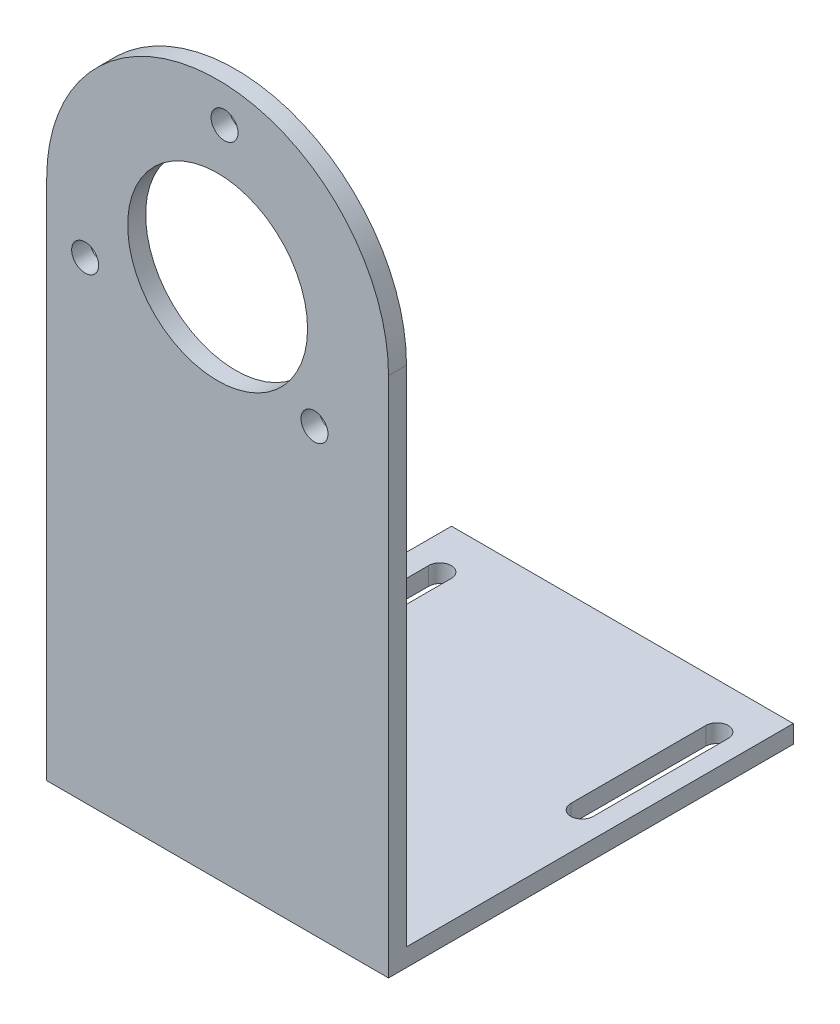
ISO-10303-21;
HEADER;
FILE_DESCRIPTION(('STEP AP214'),'2;1');
FILE_NAME('part.step','',(''),(''),'','','');
FILE_SCHEMA(('AUTOMOTIVE_DESIGN { 1 0 10303 214 1 1 1 1 }'));
ENDSEC;
DATA;
#1=APPLICATION_CONTEXT('core data for automotive mechanical design processes');
#2=APPLICATION_PROTOCOL_DEFINITION('international standard','automotive_design',2000,#1);
#3=PRODUCT_CONTEXT('',#1,'mechanical');
#4=PRODUCT('Part','Part','',(#3));
#5=PRODUCT_RELATED_PRODUCT_CATEGORY('part','',(#4));
#6=PRODUCT_DEFINITION_FORMATION('','',#4);
#7=PRODUCT_DEFINITION_CONTEXT('part definition',#1,'design');
#8=PRODUCT_DEFINITION('design','',#6,#7);
#9=PRODUCT_DEFINITION_SHAPE('','',#8);
#10=(LENGTH_UNIT() NAMED_UNIT(*) SI_UNIT(.MILLI.,.METRE.));
#11=(NAMED_UNIT(*) PLANE_ANGLE_UNIT() SI_UNIT($,.RADIAN.));
#12=(NAMED_UNIT(*) SI_UNIT($,.STERADIAN.) SOLID_ANGLE_UNIT());
#13=UNCERTAINTY_MEASURE_WITH_UNIT(LENGTH_MEASURE(1.E-05),#10,'distance_accuracy_value','');
#14=(GEOMETRIC_REPRESENTATION_CONTEXT(3) GLOBAL_UNCERTAINTY_ASSIGNED_CONTEXT((#13)) GLOBAL_UNIT_ASSIGNED_CONTEXT((#10,
#11,#12)) REPRESENTATION_CONTEXT('',''));
#15=CARTESIAN_POINT('',(0.,0.,0.));
#16=DIRECTION('',(0.,0.,1.));
#17=DIRECTION('',(1.,0.,0.));
#18=AXIS2_PLACEMENT_3D('',#15,#16,#17);
#19=CARTESIAN_POINT('',(-31.7702658504087,2.,-20.5517876073027));
#20=DIRECTION('',(1.,0.,0.));
#21=DIRECTION('',(0.,0.,-1.));
#22=AXIS2_PLACEMENT_3D('',#19,#20,#21);
#23=PLANE('',#22);
#24=DIRECTION('',(0.,0.,1.));
#25=VECTOR('',#24,1.);
#26=CARTESIAN_POINT('',(-31.7702658504087,0.,-20.5517876073027));
#27=LINE('',#26,#25);
#28=CARTESIAN_POINT('',(-31.7702658504087,0.,-20.5517876073027));
#29=VERTEX_POINT('',#28);
#30=CARTESIAN_POINT('',(-31.7702658504087,0.,24.4482123926973));
#31=VERTEX_POINT('',#30);
#32=EDGE_CURVE('E234',#29,#31,#27,.T.);
#33=ORIENTED_EDGE('',*,*,#32,.T.);
#34=DIRECTION('',(0.,-1.,0.));
#35=VECTOR('',#34,1.);
#36=CARTESIAN_POINT('',(-31.7702658504087,2.,24.4482123926973));
#37=LINE('',#36,#35);
#38=CARTESIAN_POINT('',(-31.7702658504087,58.,24.4482123926973));
#39=VERTEX_POINT('',#38);
#40=EDGE_CURVE('E11',#39,#31,#37,.T.);
#41=ORIENTED_EDGE('',*,*,#40,.F.);
#42=DIRECTION('',(0.,0.,1.));
#43=VECTOR('',#42,1.);
#44=CARTESIAN_POINT('',(-31.7702658504087,58.,22.4482123926973));
#45=LINE('',#44,#43);
#46=CARTESIAN_POINT('',(-31.7702658504087,58.,22.4482123926973));
#47=VERTEX_POINT('',#46);
#48=EDGE_CURVE('E230',#47,#39,#45,.T.);
#49=ORIENTED_EDGE('',*,*,#48,.F.);
#50=DIRECTION('',(0.,-1.,0.));
#51=VECTOR('',#50,1.);
#52=CARTESIAN_POINT('',(-31.7702658504087,0.,22.4482123926973));
#53=LINE('',#52,#51);
#54=CARTESIAN_POINT('',(-31.7702658504087,2.,22.4482123926973));
#55=VERTEX_POINT('',#54);
#56=EDGE_CURVE('E217',#47,#55,#53,.T.);
#57=ORIENTED_EDGE('',*,*,#56,.T.);
#58=DIRECTION('',(0.,0.,1.));
#59=VECTOR('',#58,1.);
#60=CARTESIAN_POINT('',(-31.7702658504087,2.,-20.5517876073027));
#61=LINE('',#60,#59);
#62=CARTESIAN_POINT('',(-31.7702658504087,2.,-20.5517876073027));
#63=VERTEX_POINT('',#62);
#64=EDGE_CURVE('E236',#63,#55,#61,.T.);
#65=ORIENTED_EDGE('',*,*,#64,.F.);
#66=DIRECTION('',(0.,-1.,0.));
#67=VECTOR('',#66,1.);
#68=CARTESIAN_POINT('',(-31.7702658504087,2.,-20.5517876073027));
#69=LINE('',#68,#67);
#70=EDGE_CURVE('E243',#63,#29,#69,.T.);
#71=ORIENTED_EDGE('',*,*,#70,.T.);
#72=EDGE_LOOP('',(#33,#41,#49,#57,#65,#71));
#73=FACE_BOUND('',#72,.T.);
#74=ADVANCED_FACE('F37',(#73),#23,.F.);
#75=CARTESIAN_POINT('',(-31.7702658504087,2.,24.4482123926973));
#76=DIRECTION('',(0.,0.,-1.));
#77=DIRECTION('',(-1.,0.,0.));
#78=AXIS2_PLACEMENT_3D('',#75,#76,#77);
#79=PLANE('',#78);
#80=CARTESIAN_POINT('',(-12.,73.,24.4482123926973));
#81=DIRECTION('',(0.,0.,1.));
#82=DIRECTION('',(1.,0.,0.));
#83=AXIS2_PLACEMENT_3D('',#80,#81,#82);
#84=CIRCLE('',#83,1.5);
#85=CARTESIAN_POINT('',(-10.5,73.,24.4482123926973));
#86=VERTEX_POINT('',#85);
#87=EDGE_CURVE('E505',#86,#86,#84,.T.);
#88=ORIENTED_EDGE('',*,*,#87,.F.);
#89=EDGE_LOOP('',(#88));
#90=FACE_BOUND('',#89,.T.);
#91=CARTESIAN_POINT('',(-2.,49.,24.4482123926973));
#92=DIRECTION('',(0.,0.,1.));
#93=DIRECTION('',(1.,0.,0.));
#94=AXIS2_PLACEMENT_3D('',#91,#92,#93);
#95=CIRCLE('',#94,1.5);
#96=CARTESIAN_POINT('',(-0.499999999999998,49.,24.4482123926973));
#97=VERTEX_POINT('',#96);
#98=EDGE_CURVE('E510',#97,#97,#95,.T.);
#99=ORIENTED_EDGE('',*,*,#98,.F.);
#100=EDGE_LOOP('',(#99));
#101=FACE_BOUND('',#100,.T.);
#102=CARTESIAN_POINT('',(-27.5,52.5,24.4482123926973));
#103=DIRECTION('',(0.,0.,1.));
#104=DIRECTION('',(1.,0.,0.));
#105=AXIS2_PLACEMENT_3D('',#102,#103,#104);
#106=CIRCLE('',#105,1.5);
#107=CARTESIAN_POINT('',(-26.,52.5,24.4482123926973));
#108=VERTEX_POINT('',#107);
#109=EDGE_CURVE('E164',#108,#108,#106,.T.);
#110=ORIENTED_EDGE('',*,*,#109,.F.);
#111=EDGE_LOOP('',(#110));
#112=FACE_BOUND('',#111,.T.);
#113=DIRECTION('',(1.,0.,0.));
#114=VECTOR('',#113,1.);
#115=CARTESIAN_POINT('',(-31.7702658504087,0.,24.4482123926973));
#116=LINE('',#115,#114);
#117=CARTESIAN_POINT('',(6.22973414959135,0.,24.4482123926973));
#118=VERTEX_POINT('',#117);
#119=EDGE_CURVE('E246',#31,#118,#116,.T.);
#120=ORIENTED_EDGE('',*,*,#119,.T.);
#121=DIRECTION('',(0.,-1.,0.));
#122=VECTOR('',#121,1.);
#123=CARTESIAN_POINT('',(6.22973414959135,2.,24.4482123926973));
#124=LINE('',#123,#122);
#125=CARTESIAN_POINT('',(6.22973414959135,58.,24.4482123926973));
#126=VERTEX_POINT('',#125);
#127=EDGE_CURVE('E44',#126,#118,#124,.T.);
#128=ORIENTED_EDGE('',*,*,#127,.F.);
#129=CARTESIAN_POINT('',(-12.7702658504087,58.,24.4482123926973));
#130=DIRECTION('',(0.,0.,1.));
#131=DIRECTION('',(1.,0.,0.));
#132=AXIS2_PLACEMENT_3D('',#129,#130,#131);
#133=CIRCLE('',#132,19.);
#134=EDGE_CURVE('E215',#126,#39,#133,.T.);
#135=ORIENTED_EDGE('',*,*,#134,.T.);
#136=ORIENTED_EDGE('',*,*,#40,.T.);
#137=EDGE_LOOP('',(#120,#128,#135,#136));
#138=FACE_BOUND('',#137,.T.);
#139=CARTESIAN_POINT('',(-12.7702658504087,58.,24.4482123926973));
#140=DIRECTION('',(0.,0.,1.));
#141=DIRECTION('',(1.,0.,0.));
#142=AXIS2_PLACEMENT_3D('',#139,#140,#141);
#143=CIRCLE('',#142,10.);
#144=CARTESIAN_POINT('',(-2.77026585040865,58.,24.4482123926973));
#145=VERTEX_POINT('',#144);
#146=EDGE_CURVE('E177',#145,#145,#143,.T.);
#147=ORIENTED_EDGE('',*,*,#146,.F.);
#148=EDGE_LOOP('',(#147));
#149=FACE_BOUND('',#148,.T.);
#150=ADVANCED_FACE('F284',(#90,#101,#112,#138,#149),#79,.F.);
#151=CARTESIAN_POINT('',(6.22973414959134,2.,-20.5517876073027));
#152=DIRECTION('',(-1.,0.,0.));
#153=DIRECTION('',(0.,0.,1.));
#154=AXIS2_PLACEMENT_3D('',#151,#152,#153);
#155=PLANE('',#154);
#156=DIRECTION('',(0.,0.,-1.));
#157=VECTOR('',#156,1.);
#158=CARTESIAN_POINT('',(6.22973414959134,0.,-20.5517876073027));
#159=LINE('',#158,#157);
#160=CARTESIAN_POINT('',(6.22973414959134,0.,-20.5517876073027));
#161=VERTEX_POINT('',#160);
#162=EDGE_CURVE('E248',#118,#161,#159,.T.);
#163=ORIENTED_EDGE('',*,*,#162,.T.);
#164=DIRECTION('',(0.,-1.,0.));
#165=VECTOR('',#164,1.);
#166=CARTESIAN_POINT('',(6.22973414959134,2.,-20.5517876073027));
#167=LINE('',#166,#165);
#168=CARTESIAN_POINT('',(6.22973414959134,2.,-20.5517876073027));
#169=VERTEX_POINT('',#168);
#170=EDGE_CURVE('E253',#169,#161,#167,.T.);
#171=ORIENTED_EDGE('',*,*,#170,.F.);
#172=DIRECTION('',(0.,0.,-1.));
#173=VECTOR('',#172,1.);
#174=CARTESIAN_POINT('',(6.22973414959134,2.,-20.5517876073027));
#175=LINE('',#174,#173);
#176=CARTESIAN_POINT('',(6.22973414959135,2.,22.4482123926973));
#177=VERTEX_POINT('',#176);
#178=EDGE_CURVE('E238',#177,#169,#175,.T.);
#179=ORIENTED_EDGE('',*,*,#178,.F.);
#180=DIRECTION('',(0.,-1.,0.));
#181=VECTOR('',#180,1.);
#182=CARTESIAN_POINT('',(6.22973414959135,0.,22.4482123926973));
#183=LINE('',#182,#181);
#184=CARTESIAN_POINT('',(6.22973414959135,58.,22.4482123926973));
#185=VERTEX_POINT('',#184);
#186=EDGE_CURVE('E227',#185,#177,#183,.T.);
#187=ORIENTED_EDGE('',*,*,#186,.F.);
#188=DIRECTION('',(0.,0.,1.));
#189=VECTOR('',#188,1.);
#190=CARTESIAN_POINT('',(6.22973414959135,58.,22.4482123926973));
#191=LINE('',#190,#189);
#192=EDGE_CURVE('E231',#185,#126,#191,.T.);
#193=ORIENTED_EDGE('',*,*,#192,.T.);
#194=ORIENTED_EDGE('',*,*,#127,.T.);
#195=EDGE_LOOP('',(#163,#171,#179,#187,#193,#194));
#196=FACE_BOUND('',#195,.T.);
#197=ADVANCED_FACE('F259',(#196),#155,.F.);
#198=CARTESIAN_POINT('',(-31.7702658504087,2.,-20.5517876073027));
#199=DIRECTION('',(0.,0.,1.));
#200=DIRECTION('',(1.,0.,0.));
#201=AXIS2_PLACEMENT_3D('',#198,#199,#200);
#202=PLANE('',#201);
#203=DIRECTION('',(-1.,0.,0.));
#204=VECTOR('',#203,1.);
#205=CARTESIAN_POINT('',(-31.7702658504087,0.,-20.5517876073027));
#206=LINE('',#205,#204);
#207=EDGE_CURVE('E239',#161,#29,#206,.T.);
#208=ORIENTED_EDGE('',*,*,#207,.T.);
#209=ORIENTED_EDGE('',*,*,#70,.F.);
#210=DIRECTION('',(-1.,0.,0.));
#211=VECTOR('',#210,1.);
#212=CARTESIAN_POINT('',(-31.7702658504087,2.,-20.5517876073027));
#213=LINE('',#212,#211);
#214=EDGE_CURVE('E241',#169,#63,#213,.T.);
#215=ORIENTED_EDGE('',*,*,#214,.F.);
#216=ORIENTED_EDGE('',*,*,#170,.T.);
#217=EDGE_LOOP('',(#208,#209,#215,#216));
#218=FACE_BOUND('',#217,.T.);
#219=ADVANCED_FACE('F269',(#218),#202,.F.);
#220=CARTESIAN_POINT('',(0.,2.,0.));
#221=DIRECTION('',(0.,1.,0.));
#222=DIRECTION('',(0.,0.,1.));
#223=AXIS2_PLACEMENT_3D('',#220,#221,#222);
#224=PLANE('',#223);
#225=CARTESIAN_POINT('',(2.8,2.,-0.5));
#226=DIRECTION('',(0.,1.,0.));
#227=DIRECTION('',(0.,0.,1.));
#228=AXIS2_PLACEMENT_3D('',#225,#226,#227);
#229=CIRCLE('',#228,1.25);
#230=CARTESIAN_POINT('',(1.55,2.,-0.5));
#231=VERTEX_POINT('',#230);
#232=CARTESIAN_POINT('',(4.05,2.,-0.5));
#233=VERTEX_POINT('',#232);
#234=EDGE_CURVE('E51',#231,#233,#229,.T.);
#235=ORIENTED_EDGE('',*,*,#234,.F.);
#236=DIRECTION('',(0.,0.,1.));
#237=VECTOR('',#236,1.);
#238=CARTESIAN_POINT('',(1.55,2.,-0.5));
#239=LINE('',#238,#237);
#240=CARTESIAN_POINT('',(1.55,2.,-15.5));
#241=VERTEX_POINT('',#240);
#242=EDGE_CURVE('E158',#241,#231,#239,.T.);
#243=ORIENTED_EDGE('',*,*,#242,.F.);
#244=CARTESIAN_POINT('',(2.8,2.,-15.5));
#245=DIRECTION('',(0.,1.,0.));
#246=DIRECTION('',(0.,0.,1.));
#247=AXIS2_PLACEMENT_3D('',#244,#245,#246);
#248=CIRCLE('',#247,1.25);
#249=CARTESIAN_POINT('',(4.05,2.,-15.5));
#250=VERTEX_POINT('',#249);
#251=EDGE_CURVE('E161',#250,#241,#248,.T.);
#252=ORIENTED_EDGE('',*,*,#251,.F.);
#253=DIRECTION('',(0.,0.,-1.));
#254=VECTOR('',#253,1.);
#255=CARTESIAN_POINT('',(4.05,2.,-0.5));
#256=LINE('',#255,#254);
#257=EDGE_CURVE('E170',#233,#250,#256,.T.);
#258=ORIENTED_EDGE('',*,*,#257,.F.);
#259=EDGE_LOOP('',(#235,#243,#252,#258));
#260=FACE_BOUND('',#259,.T.);
#261=CARTESIAN_POINT('',(-28.,2.,-0.5));
#262=DIRECTION('',(0.,1.,0.));
#263=DIRECTION('',(0.,0.,1.));
#264=AXIS2_PLACEMENT_3D('',#261,#262,#263);
#265=CIRCLE('',#264,1.25);
#266=CARTESIAN_POINT('',(-29.25,2.,-0.5));
#267=VERTEX_POINT('',#266);
#268=CARTESIAN_POINT('',(-26.75,2.,-0.5));
#269=VERTEX_POINT('',#268);
#270=EDGE_CURVE('E59',#267,#269,#265,.T.);
#271=ORIENTED_EDGE('',*,*,#270,.F.);
#272=DIRECTION('',(0.,0.,1.));
#273=VECTOR('',#272,1.);
#274=CARTESIAN_POINT('',(-29.25,2.,-0.5));
#275=LINE('',#274,#273);
#276=CARTESIAN_POINT('',(-29.25,2.,-15.5));
#277=VERTEX_POINT('',#276);
#278=EDGE_CURVE('E185',#277,#267,#275,.T.);
#279=ORIENTED_EDGE('',*,*,#278,.F.);
#280=CARTESIAN_POINT('',(-28.,2.,-15.5));
#281=DIRECTION('',(0.,1.,0.));
#282=DIRECTION('',(0.,0.,1.));
#283=AXIS2_PLACEMENT_3D('',#280,#281,#282);
#284=CIRCLE('',#283,1.25);
#285=CARTESIAN_POINT('',(-26.75,2.,-15.5));
#286=VERTEX_POINT('',#285);
#287=EDGE_CURVE('E200',#286,#277,#284,.T.);
#288=ORIENTED_EDGE('',*,*,#287,.F.);
#289=DIRECTION('',(0.,0.,-1.));
#290=VECTOR('',#289,1.);
#291=CARTESIAN_POINT('',(-26.75,2.,-0.5));
#292=LINE('',#291,#290);
#293=EDGE_CURVE('E196',#269,#286,#292,.T.);
#294=ORIENTED_EDGE('',*,*,#293,.F.);
#295=EDGE_LOOP('',(#271,#279,#288,#294));
#296=FACE_BOUND('',#295,.T.);
#297=DIRECTION('',(-1.,0.,0.));
#298=VECTOR('',#297,1.);
#299=CARTESIAN_POINT('',(0.,2.,22.4482123926973));
#300=LINE('',#299,#298);
#301=EDGE_CURVE('E224',#177,#55,#300,.T.);
#302=ORIENTED_EDGE('',*,*,#301,.F.);
#303=ORIENTED_EDGE('',*,*,#178,.T.);
#304=ORIENTED_EDGE('',*,*,#214,.T.);
#305=ORIENTED_EDGE('',*,*,#64,.T.);
#306=EDGE_LOOP('',(#302,#303,#304,#305));
#307=FACE_BOUND('',#306,.T.);
#308=ADVANCED_FACE('F277',(#260,#296,#307),#224,.T.);
#309=CARTESIAN_POINT('',(0.,0.,0.));
#310=DIRECTION('',(0.,1.,0.));
#311=DIRECTION('',(0.,0.,1.));
#312=AXIS2_PLACEMENT_3D('',#309,#310,#311);
#313=PLANE('',#312);
#314=DIRECTION('',(0.,0.,1.));
#315=VECTOR('',#314,1.);
#316=CARTESIAN_POINT('',(1.55,0.,-0.5));
#317=LINE('',#316,#315);
#318=CARTESIAN_POINT('',(1.55,0.,-15.5));
#319=VERTEX_POINT('',#318);
#320=CARTESIAN_POINT('',(1.55,0.,-0.5));
#321=VERTEX_POINT('',#320);
#322=EDGE_CURVE('E145',#319,#321,#317,.T.);
#323=ORIENTED_EDGE('',*,*,#322,.T.);
#324=CARTESIAN_POINT('',(2.8,0.,-0.5));
#325=DIRECTION('',(0.,1.,0.));
#326=DIRECTION('',(0.,0.,1.));
#327=AXIS2_PLACEMENT_3D('',#324,#325,#326);
#328=CIRCLE('',#327,1.25);
#329=CARTESIAN_POINT('',(4.05,0.,-0.5));
#330=VERTEX_POINT('',#329);
#331=EDGE_CURVE('E139',#321,#330,#328,.T.);
#332=ORIENTED_EDGE('',*,*,#331,.T.);
#333=DIRECTION('',(0.,0.,-1.));
#334=VECTOR('',#333,1.);
#335=CARTESIAN_POINT('',(4.05,0.,-0.5));
#336=LINE('',#335,#334);
#337=CARTESIAN_POINT('',(4.05,0.,-15.5));
#338=VERTEX_POINT('',#337);
#339=EDGE_CURVE('E149',#330,#338,#336,.T.);
#340=ORIENTED_EDGE('',*,*,#339,.T.);
#341=CARTESIAN_POINT('',(2.8,0.,-15.5));
#342=DIRECTION('',(0.,1.,0.));
#343=DIRECTION('',(0.,0.,1.));
#344=AXIS2_PLACEMENT_3D('',#341,#342,#343);
#345=CIRCLE('',#344,1.25);
#346=EDGE_CURVE('E153',#338,#319,#345,.T.);
#347=ORIENTED_EDGE('',*,*,#346,.T.);
#348=EDGE_LOOP('',(#323,#332,#340,#347));
#349=FACE_BOUND('',#348,.T.);
#350=DIRECTION('',(0.,0.,1.));
#351=VECTOR('',#350,1.);
#352=CARTESIAN_POINT('',(-29.25,0.,-0.5));
#353=LINE('',#352,#351);
#354=CARTESIAN_POINT('',(-29.25,0.,-15.5));
#355=VERTEX_POINT('',#354);
#356=CARTESIAN_POINT('',(-29.25,0.,-0.5));
#357=VERTEX_POINT('',#356);
#358=EDGE_CURVE('E191',#355,#357,#353,.T.);
#359=ORIENTED_EDGE('',*,*,#358,.T.);
#360=CARTESIAN_POINT('',(-28.,0.,-0.5));
#361=DIRECTION('',(0.,1.,0.));
#362=DIRECTION('',(0.,0.,1.));
#363=AXIS2_PLACEMENT_3D('',#360,#361,#362);
#364=CIRCLE('',#363,1.25);
#365=CARTESIAN_POINT('',(-26.75,0.,-0.5));
#366=VERTEX_POINT('',#365);
#367=EDGE_CURVE('E181',#357,#366,#364,.T.);
#368=ORIENTED_EDGE('',*,*,#367,.T.);
#369=DIRECTION('',(0.,0.,-1.));
#370=VECTOR('',#369,1.);
#371=CARTESIAN_POINT('',(-26.75,0.,-0.5));
#372=LINE('',#371,#370);
#373=CARTESIAN_POINT('',(-26.75,0.,-15.5));
#374=VERTEX_POINT('',#373);
#375=EDGE_CURVE('E184',#366,#374,#372,.T.);
#376=ORIENTED_EDGE('',*,*,#375,.T.);
#377=CARTESIAN_POINT('',(-28.,0.,-15.5));
#378=DIRECTION('',(0.,1.,0.));
#379=DIRECTION('',(0.,0.,1.));
#380=AXIS2_PLACEMENT_3D('',#377,#378,#379);
#381=CIRCLE('',#380,1.25);
#382=EDGE_CURVE('E188',#374,#355,#381,.T.);
#383=ORIENTED_EDGE('',*,*,#382,.T.);
#384=EDGE_LOOP('',(#359,#368,#376,#383));
#385=FACE_BOUND('',#384,.T.);
#386=ORIENTED_EDGE('',*,*,#32,.F.);
#387=ORIENTED_EDGE('',*,*,#207,.F.);
#388=ORIENTED_EDGE('',*,*,#162,.F.);
#389=ORIENTED_EDGE('',*,*,#119,.F.);
#390=EDGE_LOOP('',(#386,#387,#388,#389));
#391=FACE_BOUND('',#390,.T.);
#392=ADVANCED_FACE('F155',(#349,#385,#391),#313,.F.);
#393=CARTESIAN_POINT('',(0.,0.,22.4482123926973));
#394=DIRECTION('',(0.,0.,1.));
#395=DIRECTION('',(1.,0.,0.));
#396=AXIS2_PLACEMENT_3D('',#393,#394,#395);
#397=PLANE('',#396);
#398=CARTESIAN_POINT('',(-12.,73.,22.4482123926973));
#399=DIRECTION('',(0.,0.,1.));
#400=DIRECTION('',(1.,0.,0.));
#401=AXIS2_PLACEMENT_3D('',#398,#399,#400);
#402=CIRCLE('',#401,1.5);
#403=CARTESIAN_POINT('',(-10.5,73.,22.4482123926973));
#404=VERTEX_POINT('',#403);
#405=EDGE_CURVE('E197',#404,#404,#402,.T.);
#406=ORIENTED_EDGE('',*,*,#405,.T.);
#407=EDGE_LOOP('',(#406));
#408=FACE_BOUND('',#407,.T.);
#409=CARTESIAN_POINT('',(-2.,49.,22.4482123926973));
#410=DIRECTION('',(0.,0.,1.));
#411=DIRECTION('',(1.,0.,0.));
#412=AXIS2_PLACEMENT_3D('',#409,#410,#411);
#413=CIRCLE('',#412,1.5);
#414=CARTESIAN_POINT('',(-0.499999999999998,49.,22.4482123926973));
#415=VERTEX_POINT('',#414);
#416=EDGE_CURVE('E506',#415,#415,#413,.T.);
#417=ORIENTED_EDGE('',*,*,#416,.T.);
#418=EDGE_LOOP('',(#417));
#419=FACE_BOUND('',#418,.T.);
#420=CARTESIAN_POINT('',(-27.5,52.5,22.4482123926973));
#421=DIRECTION('',(0.,0.,1.));
#422=DIRECTION('',(1.,0.,0.));
#423=AXIS2_PLACEMENT_3D('',#420,#421,#422);
#424=CIRCLE('',#423,1.5);
#425=CARTESIAN_POINT('',(-26.,52.5,22.4482123926973));
#426=VERTEX_POINT('',#425);
#427=EDGE_CURVE('E514',#426,#426,#424,.T.);
#428=ORIENTED_EDGE('',*,*,#427,.T.);
#429=EDGE_LOOP('',(#428));
#430=FACE_BOUND('',#429,.T.);
#431=ORIENTED_EDGE('',*,*,#56,.F.);
#432=CARTESIAN_POINT('',(-12.7702658504087,58.,22.4482123926973));
#433=DIRECTION('',(0.,0.,1.));
#434=DIRECTION('',(1.,0.,0.));
#435=AXIS2_PLACEMENT_3D('',#432,#433,#434);
#436=CIRCLE('',#435,19.);
#437=EDGE_CURVE('E214',#185,#47,#436,.T.);
#438=ORIENTED_EDGE('',*,*,#437,.F.);
#439=ORIENTED_EDGE('',*,*,#186,.T.);
#440=ORIENTED_EDGE('',*,*,#301,.T.);
#441=EDGE_LOOP('',(#431,#438,#439,#440));
#442=FACE_BOUND('',#441,.T.);
#443=CARTESIAN_POINT('',(-12.7702658504087,58.,22.4482123926973));
#444=DIRECTION('',(0.,0.,1.));
#445=DIRECTION('',(1.,0.,0.));
#446=AXIS2_PLACEMENT_3D('',#443,#444,#445);
#447=CIRCLE('',#446,10.);
#448=CARTESIAN_POINT('',(-2.77026585040865,58.,22.4482123926973));
#449=VERTEX_POINT('',#448);
#450=EDGE_CURVE('E211',#449,#449,#447,.T.);
#451=ORIENTED_EDGE('',*,*,#450,.T.);
#452=EDGE_LOOP('',(#451));
#453=FACE_BOUND('',#452,.T.);
#454=ADVANCED_FACE('F280',(#408,#419,#430,#442,#453),#397,.F.);
#455=CARTESIAN_POINT('',(-12.7702658504087,58.,22.4482123926973));
#456=DIRECTION('',(0.,0.,1.));
#457=DIRECTION('',(1.,0.,0.));
#458=AXIS2_PLACEMENT_3D('',#455,#456,#457);
#459=CYLINDRICAL_SURFACE('',#458,10.);
#460=ORIENTED_EDGE('',*,*,#450,.F.);
#461=EDGE_LOOP('',(#460));
#462=FACE_BOUND('',#461,.T.);
#463=ORIENTED_EDGE('',*,*,#146,.T.);
#464=EDGE_LOOP('',(#463));
#465=FACE_BOUND('',#464,.T.);
#466=ADVANCED_FACE('F290',(#462,#465),#459,.F.);
#467=CARTESIAN_POINT('',(-12.7702658504087,58.,22.4482123926973));
#468=DIRECTION('',(0.,0.,1.));
#469=DIRECTION('',(1.,0.,0.));
#470=AXIS2_PLACEMENT_3D('',#467,#468,#469);
#471=CYLINDRICAL_SURFACE('',#470,19.);
#472=ORIENTED_EDGE('',*,*,#437,.T.);
#473=ORIENTED_EDGE('',*,*,#48,.T.);
#474=ORIENTED_EDGE('',*,*,#134,.F.);
#475=ORIENTED_EDGE('',*,*,#192,.F.);
#476=EDGE_LOOP('',(#472,#473,#474,#475));
#477=FACE_BOUND('',#476,.T.);
#478=ADVANCED_FACE('F283',(#477),#471,.T.);
#479=CARTESIAN_POINT('',(-28.,0.,-0.5));
#480=DIRECTION('',(0.,1.,0.));
#481=DIRECTION('',(0.,0.,1.));
#482=AXIS2_PLACEMENT_3D('',#479,#480,#481);
#483=CYLINDRICAL_SURFACE('',#482,1.25);
#484=ORIENTED_EDGE('',*,*,#270,.T.);
#485=DIRECTION('',(0.,1.,0.));
#486=VECTOR('',#485,1.);
#487=CARTESIAN_POINT('',(-26.75,0.,-0.5));
#488=LINE('',#487,#486);
#489=EDGE_CURVE('E194',#366,#269,#488,.T.);
#490=ORIENTED_EDGE('',*,*,#489,.F.);
#491=ORIENTED_EDGE('',*,*,#367,.F.);
#492=DIRECTION('',(0.,1.,0.));
#493=VECTOR('',#492,1.);
#494=CARTESIAN_POINT('',(-29.25,0.,-0.5));
#495=LINE('',#494,#493);
#496=EDGE_CURVE('E171',#357,#267,#495,.T.);
#497=ORIENTED_EDGE('',*,*,#496,.T.);
#498=EDGE_LOOP('',(#484,#490,#491,#497));
#499=FACE_BOUND('',#498,.T.);
#500=ADVANCED_FACE('F298',(#499),#483,.F.);
#501=CARTESIAN_POINT('',(-29.25,0.,-0.5));
#502=DIRECTION('',(-1.,0.,0.));
#503=DIRECTION('',(0.,0.,1.));
#504=AXIS2_PLACEMENT_3D('',#501,#502,#503);
#505=PLANE('',#504);
#506=ORIENTED_EDGE('',*,*,#278,.T.);
#507=ORIENTED_EDGE('',*,*,#496,.F.);
#508=ORIENTED_EDGE('',*,*,#358,.F.);
#509=DIRECTION('',(0.,1.,0.));
#510=VECTOR('',#509,1.);
#511=CARTESIAN_POINT('',(-29.25,0.,-15.5));
#512=LINE('',#511,#510);
#513=EDGE_CURVE('E206',#355,#277,#512,.T.);
#514=ORIENTED_EDGE('',*,*,#513,.T.);
#515=EDGE_LOOP('',(#506,#507,#508,#514));
#516=FACE_BOUND('',#515,.T.);
#517=ADVANCED_FACE('F395',(#516),#505,.F.);
#518=CARTESIAN_POINT('',(-28.,0.,-15.5));
#519=DIRECTION('',(0.,1.,0.));
#520=DIRECTION('',(0.,0.,1.));
#521=AXIS2_PLACEMENT_3D('',#518,#519,#520);
#522=CYLINDRICAL_SURFACE('',#521,1.25);
#523=ORIENTED_EDGE('',*,*,#287,.T.);
#524=ORIENTED_EDGE('',*,*,#513,.F.);
#525=ORIENTED_EDGE('',*,*,#382,.F.);
#526=DIRECTION('',(0.,1.,0.));
#527=VECTOR('',#526,1.);
#528=CARTESIAN_POINT('',(-26.75,0.,-15.5));
#529=LINE('',#528,#527);
#530=EDGE_CURVE('E208',#374,#286,#529,.T.);
#531=ORIENTED_EDGE('',*,*,#530,.T.);
#532=EDGE_LOOP('',(#523,#524,#525,#531));
#533=FACE_BOUND('',#532,.T.);
#534=ADVANCED_FACE('F398',(#533),#522,.F.);
#535=CARTESIAN_POINT('',(-26.75,0.,-0.5));
#536=DIRECTION('',(1.,0.,0.));
#537=DIRECTION('',(0.,0.,-1.));
#538=AXIS2_PLACEMENT_3D('',#535,#536,#537);
#539=PLANE('',#538);
#540=ORIENTED_EDGE('',*,*,#293,.T.);
#541=ORIENTED_EDGE('',*,*,#530,.F.);
#542=ORIENTED_EDGE('',*,*,#375,.F.);
#543=ORIENTED_EDGE('',*,*,#489,.T.);
#544=EDGE_LOOP('',(#540,#541,#542,#543));
#545=FACE_BOUND('',#544,.T.);
#546=ADVANCED_FACE('F394',(#545),#539,.F.);
#547=CARTESIAN_POINT('',(2.8,0.,-0.5));
#548=DIRECTION('',(0.,1.,0.));
#549=DIRECTION('',(0.,0.,1.));
#550=AXIS2_PLACEMENT_3D('',#547,#548,#549);
#551=CYLINDRICAL_SURFACE('',#550,1.25);
#552=ORIENTED_EDGE('',*,*,#234,.T.);
#553=DIRECTION('',(0.,1.,0.));
#554=VECTOR('',#553,1.);
#555=CARTESIAN_POINT('',(4.05,0.,-0.5));
#556=LINE('',#555,#554);
#557=EDGE_CURVE('E135',#330,#233,#556,.T.);
#558=ORIENTED_EDGE('',*,*,#557,.F.);
#559=ORIENTED_EDGE('',*,*,#331,.F.);
#560=DIRECTION('',(0.,1.,0.));
#561=VECTOR('',#560,1.);
#562=CARTESIAN_POINT('',(1.55,0.,-0.5));
#563=LINE('',#562,#561);
#564=EDGE_CURVE('E175',#321,#231,#563,.T.);
#565=ORIENTED_EDGE('',*,*,#564,.T.);
#566=EDGE_LOOP('',(#552,#558,#559,#565));
#567=FACE_BOUND('',#566,.T.);
#568=ADVANCED_FACE('F137',(#567),#551,.F.);
#569=CARTESIAN_POINT('',(1.55,0.,-0.5));
#570=DIRECTION('',(-1.,0.,0.));
#571=DIRECTION('',(0.,0.,1.));
#572=AXIS2_PLACEMENT_3D('',#569,#570,#571);
#573=PLANE('',#572);
#574=ORIENTED_EDGE('',*,*,#242,.T.);
#575=ORIENTED_EDGE('',*,*,#564,.F.);
#576=ORIENTED_EDGE('',*,*,#322,.F.);
#577=DIRECTION('',(0.,1.,0.));
#578=VECTOR('',#577,1.);
#579=CARTESIAN_POINT('',(1.55,0.,-15.5));
#580=LINE('',#579,#578);
#581=EDGE_CURVE('E178',#319,#241,#580,.T.);
#582=ORIENTED_EDGE('',*,*,#581,.T.);
#583=EDGE_LOOP('',(#574,#575,#576,#582));
#584=FACE_BOUND('',#583,.T.);
#585=ADVANCED_FACE('F383',(#584),#573,.F.);
#586=CARTESIAN_POINT('',(2.8,0.,-15.5));
#587=DIRECTION('',(0.,1.,0.));
#588=DIRECTION('',(0.,0.,1.));
#589=AXIS2_PLACEMENT_3D('',#586,#587,#588);
#590=CYLINDRICAL_SURFACE('',#589,1.25);
#591=ORIENTED_EDGE('',*,*,#251,.T.);
#592=ORIENTED_EDGE('',*,*,#581,.F.);
#593=ORIENTED_EDGE('',*,*,#346,.F.);
#594=DIRECTION('',(0.,1.,0.));
#595=VECTOR('',#594,1.);
#596=CARTESIAN_POINT('',(4.05,0.,-15.5));
#597=LINE('',#596,#595);
#598=EDGE_CURVE('E144',#338,#250,#597,.T.);
#599=ORIENTED_EDGE('',*,*,#598,.T.);
#600=EDGE_LOOP('',(#591,#592,#593,#599));
#601=FACE_BOUND('',#600,.T.);
#602=ADVANCED_FACE('F386',(#601),#590,.F.);
#603=CARTESIAN_POINT('',(4.05,0.,-0.5));
#604=DIRECTION('',(1.,0.,0.));
#605=DIRECTION('',(0.,0.,-1.));
#606=AXIS2_PLACEMENT_3D('',#603,#604,#605);
#607=PLANE('',#606);
#608=ORIENTED_EDGE('',*,*,#257,.T.);
#609=ORIENTED_EDGE('',*,*,#598,.F.);
#610=ORIENTED_EDGE('',*,*,#339,.F.);
#611=ORIENTED_EDGE('',*,*,#557,.T.);
#612=EDGE_LOOP('',(#608,#609,#610,#611));
#613=FACE_BOUND('',#612,.T.);
#614=ADVANCED_FACE('F150',(#613),#607,.F.);
#615=CARTESIAN_POINT('',(-27.5,52.5,22.4482123926973));
#616=DIRECTION('',(0.,0.,1.));
#617=DIRECTION('',(1.,0.,0.));
#618=AXIS2_PLACEMENT_3D('',#615,#616,#617);
#619=CYLINDRICAL_SURFACE('',#618,1.5);
#620=ORIENTED_EDGE('',*,*,#427,.F.);
#621=EDGE_LOOP('',(#620));
#622=FACE_BOUND('',#621,.T.);
#623=ORIENTED_EDGE('',*,*,#109,.T.);
#624=EDGE_LOOP('',(#623));
#625=FACE_BOUND('',#624,.T.);
#626=ADVANCED_FACE('F349',(#622,#625),#619,.F.);
#627=CARTESIAN_POINT('',(-2.,49.,22.4482123926973));
#628=DIRECTION('',(0.,0.,1.));
#629=DIRECTION('',(1.,0.,0.));
#630=AXIS2_PLACEMENT_3D('',#627,#628,#629);
#631=CYLINDRICAL_SURFACE('',#630,1.5);
#632=ORIENTED_EDGE('',*,*,#416,.F.);
#633=EDGE_LOOP('',(#632));
#634=FACE_BOUND('',#633,.T.);
#635=ORIENTED_EDGE('',*,*,#98,.T.);
#636=EDGE_LOOP('',(#635));
#637=FACE_BOUND('',#636,.T.);
#638=ADVANCED_FACE('F354',(#634,#637),#631,.F.);
#639=CARTESIAN_POINT('',(-12.,73.,22.4482123926973));
#640=DIRECTION('',(0.,0.,1.));
#641=DIRECTION('',(1.,0.,0.));
#642=AXIS2_PLACEMENT_3D('',#639,#640,#641);
#643=CYLINDRICAL_SURFACE('',#642,1.5);
#644=ORIENTED_EDGE('',*,*,#405,.F.);
#645=EDGE_LOOP('',(#644));
#646=FACE_BOUND('',#645,.T.);
#647=ORIENTED_EDGE('',*,*,#87,.T.);
#648=EDGE_LOOP('',(#647));
#649=FACE_BOUND('',#648,.T.);
#650=ADVANCED_FACE('F366',(#646,#649),#643,.F.);
#651=CLOSED_SHELL('',(#74,#150,#197,#219,#308,#392,#454,#466,#478,#500,#517,#534,#546,#568,#585,
#602,#614,#626,#638,#650));
#652=MANIFOLD_SOLID_BREP('B2',#651);
#653=ADVANCED_BREP_SHAPE_REPRESENTATION('',(#18,#652),#14);
#654=SHAPE_DEFINITION_REPRESENTATION(#9,#653);
ENDSEC;
END-ISO-10303-21;
